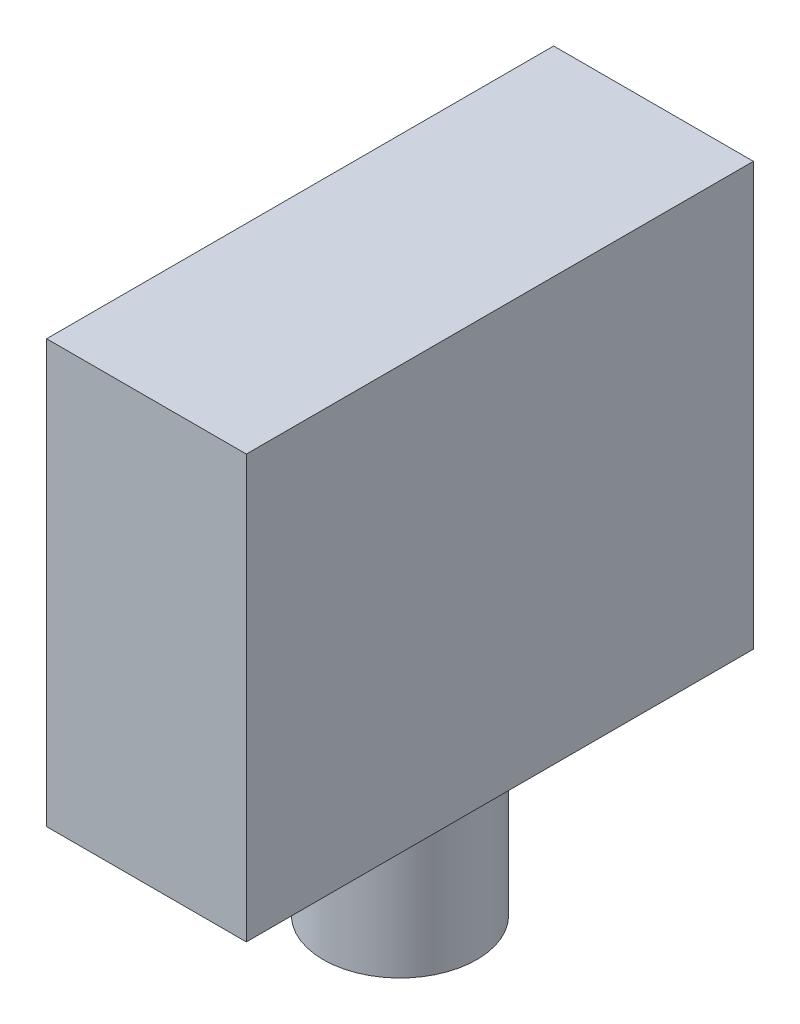
ISO-10303-21;
HEADER;
FILE_DESCRIPTION(('STEP AP214'),'2;1');
FILE_NAME('part.step','',(''),(''),'','','');
FILE_SCHEMA(('AUTOMOTIVE_DESIGN { 1 0 10303 214 1 1 1 1 }'));
ENDSEC;
DATA;
#1=APPLICATION_CONTEXT('core data for automotive mechanical design processes');
#2=APPLICATION_PROTOCOL_DEFINITION('international standard','automotive_design',2000,#1);
#3=PRODUCT_CONTEXT('',#1,'mechanical');
#4=PRODUCT('Part','Part','',(#3));
#5=PRODUCT_RELATED_PRODUCT_CATEGORY('part','',(#4));
#6=PRODUCT_DEFINITION_FORMATION('','',#4);
#7=PRODUCT_DEFINITION_CONTEXT('part definition',#1,'design');
#8=PRODUCT_DEFINITION('design','',#6,#7);
#9=PRODUCT_DEFINITION_SHAPE('','',#8);
#10=(LENGTH_UNIT() NAMED_UNIT(*) SI_UNIT(.MILLI.,.METRE.));
#11=(NAMED_UNIT(*) PLANE_ANGLE_UNIT() SI_UNIT($,.RADIAN.));
#12=(NAMED_UNIT(*) SI_UNIT($,.STERADIAN.) SOLID_ANGLE_UNIT());
#13=UNCERTAINTY_MEASURE_WITH_UNIT(LENGTH_MEASURE(1.E-05),#10,'distance_accuracy_value','');
#14=(GEOMETRIC_REPRESENTATION_CONTEXT(3) GLOBAL_UNCERTAINTY_ASSIGNED_CONTEXT((#13)) GLOBAL_UNIT_ASSIGNED_CONTEXT((#10,
#11,#12)) REPRESENTATION_CONTEXT('',''));
#15=CARTESIAN_POINT('',(0.,0.,0.));
#16=DIRECTION('',(0.,0.,1.));
#17=DIRECTION('',(1.,0.,0.));
#18=AXIS2_PLACEMENT_3D('',#15,#16,#17);
#19=CARTESIAN_POINT('',(-0.602941176470582,27.5,-12.9411764705882));
#20=DIRECTION('',(-1.,0.,0.));
#21=DIRECTION('',(0.,0.,1.));
#22=AXIS2_PLACEMENT_3D('',#19,#20,#21);
#23=PLANE('',#22);
#24=DIRECTION('',(0.,0.,-1.));
#25=VECTOR('',#24,1.);
#26=CARTESIAN_POINT('',(-0.602941176470582,0.,-12.9411764705882));
#27=LINE('',#26,#25);
#28=CARTESIAN_POINT('',(-0.60294117647058,0.,20.0588235294118));
#29=VERTEX_POINT('',#28);
#30=CARTESIAN_POINT('',(-0.602941176470582,0.,-12.9411764705882));
#31=VERTEX_POINT('',#30);
#32=EDGE_CURVE('E107',#29,#31,#27,.T.);
#33=ORIENTED_EDGE('',*,*,#32,.T.);
#34=DIRECTION('',(0.,-1.,0.));
#35=VECTOR('',#34,1.);
#36=CARTESIAN_POINT('',(-0.602941176470582,27.5,-12.9411764705882));
#37=LINE('',#36,#35);
#38=CARTESIAN_POINT('',(-0.602941176470582,27.5,-12.9411764705882));
#39=VERTEX_POINT('',#38);
#40=EDGE_CURVE('E11',#39,#31,#37,.T.);
#41=ORIENTED_EDGE('',*,*,#40,.F.);
#42=DIRECTION('',(0.,0.,-1.));
#43=VECTOR('',#42,1.);
#44=CARTESIAN_POINT('',(-0.602941176470582,27.5,-12.9411764705882));
#45=LINE('',#44,#43);
#46=CARTESIAN_POINT('',(-0.60294117647058,27.5,20.0588235294118));
#47=VERTEX_POINT('',#46);
#48=EDGE_CURVE('E91',#47,#39,#45,.T.);
#49=ORIENTED_EDGE('',*,*,#48,.F.);
#50=DIRECTION('',(0.,-1.,0.));
#51=VECTOR('',#50,1.);
#52=CARTESIAN_POINT('',(-0.60294117647058,27.5,20.0588235294118));
#53=LINE('',#52,#51);
#54=EDGE_CURVE('E103',#47,#29,#53,.T.);
#55=ORIENTED_EDGE('',*,*,#54,.T.);
#56=EDGE_LOOP('',(#33,#41,#49,#55));
#57=FACE_BOUND('',#56,.T.);
#58=ADVANCED_FACE('F39',(#57),#23,.F.);
#59=CARTESIAN_POINT('',(-0.602941176470582,27.5,-12.9411764705882));
#60=DIRECTION('',(0.,0.,1.));
#61=DIRECTION('',(1.,0.,0.));
#62=AXIS2_PLACEMENT_3D('',#59,#60,#61);
#63=PLANE('',#62);
#64=DIRECTION('',(-1.,0.,0.));
#65=VECTOR('',#64,1.);
#66=CARTESIAN_POINT('',(-0.602941176470582,0.,-12.9411764705882));
#67=LINE('',#66,#65);
#68=CARTESIAN_POINT('',(-13.6029411764706,0.,-12.9411764705882));
#69=VERTEX_POINT('',#68);
#70=EDGE_CURVE('E96',#31,#69,#67,.T.);
#71=ORIENTED_EDGE('',*,*,#70,.T.);
#72=DIRECTION('',(0.,-1.,0.));
#73=VECTOR('',#72,1.);
#74=CARTESIAN_POINT('',(-13.6029411764706,27.5,-12.9411764705882));
#75=LINE('',#74,#73);
#76=CARTESIAN_POINT('',(-13.6029411764706,27.5,-12.9411764705882));
#77=VERTEX_POINT('',#76);
#78=EDGE_CURVE('E48',#77,#69,#75,.T.);
#79=ORIENTED_EDGE('',*,*,#78,.F.);
#80=DIRECTION('',(-1.,0.,0.));
#81=VECTOR('',#80,1.);
#82=CARTESIAN_POINT('',(-0.602941176470582,27.5,-12.9411764705882));
#83=LINE('',#82,#81);
#84=EDGE_CURVE('E86',#39,#77,#83,.T.);
#85=ORIENTED_EDGE('',*,*,#84,.F.);
#86=ORIENTED_EDGE('',*,*,#40,.T.);
#87=EDGE_LOOP('',(#71,#79,#85,#86));
#88=FACE_BOUND('',#87,.T.);
#89=ADVANCED_FACE('F95',(#88),#63,.F.);
#90=CARTESIAN_POINT('',(-13.6029411764706,27.5,-12.9411764705882));
#91=DIRECTION('',(1.,0.,0.));
#92=DIRECTION('',(0.,0.,-1.));
#93=AXIS2_PLACEMENT_3D('',#90,#91,#92);
#94=PLANE('',#93);
#95=DIRECTION('',(0.,0.,1.));
#96=VECTOR('',#95,1.);
#97=CARTESIAN_POINT('',(-13.6029411764706,0.,-12.9411764705882));
#98=LINE('',#97,#96);
#99=CARTESIAN_POINT('',(-13.6029411764706,0.,20.0588235294118));
#100=VERTEX_POINT('',#99);
#101=EDGE_CURVE('E73',#69,#100,#98,.T.);
#102=ORIENTED_EDGE('',*,*,#101,.T.);
#103=DIRECTION('',(0.,-1.,0.));
#104=VECTOR('',#103,1.);
#105=CARTESIAN_POINT('',(-13.6029411764706,27.5,20.0588235294118));
#106=LINE('',#105,#104);
#107=CARTESIAN_POINT('',(-13.6029411764706,27.5,20.0588235294118));
#108=VERTEX_POINT('',#107);
#109=EDGE_CURVE('E98',#108,#100,#106,.T.);
#110=ORIENTED_EDGE('',*,*,#109,.F.);
#111=DIRECTION('',(0.,0.,1.));
#112=VECTOR('',#111,1.);
#113=CARTESIAN_POINT('',(-13.6029411764706,27.5,-12.9411764705882));
#114=LINE('',#113,#112);
#115=EDGE_CURVE('E89',#77,#108,#114,.T.);
#116=ORIENTED_EDGE('',*,*,#115,.F.);
#117=ORIENTED_EDGE('',*,*,#78,.T.);
#118=EDGE_LOOP('',(#102,#110,#116,#117));
#119=FACE_BOUND('',#118,.T.);
#120=ADVANCED_FACE('F99',(#119),#94,.F.);
#121=CARTESIAN_POINT('',(-0.60294117647058,27.5,20.0588235294118));
#122=DIRECTION('',(0.,0.,-1.));
#123=DIRECTION('',(-1.,0.,0.));
#124=AXIS2_PLACEMENT_3D('',#121,#122,#123);
#125=PLANE('',#124);
#126=DIRECTION('',(1.,0.,0.));
#127=VECTOR('',#126,1.);
#128=CARTESIAN_POINT('',(-0.60294117647058,0.,20.0588235294118));
#129=LINE('',#128,#127);
#130=EDGE_CURVE('E79',#100,#29,#129,.T.);
#131=ORIENTED_EDGE('',*,*,#130,.T.);
#132=ORIENTED_EDGE('',*,*,#54,.F.);
#133=DIRECTION('',(1.,0.,0.));
#134=VECTOR('',#133,1.);
#135=CARTESIAN_POINT('',(-0.60294117647058,27.5,20.0588235294118));
#136=LINE('',#135,#134);
#137=EDGE_CURVE('E56',#108,#47,#136,.T.);
#138=ORIENTED_EDGE('',*,*,#137,.F.);
#139=ORIENTED_EDGE('',*,*,#109,.T.);
#140=EDGE_LOOP('',(#131,#132,#138,#139));
#141=FACE_BOUND('',#140,.T.);
#142=ADVANCED_FACE('F121',(#141),#125,.F.);
#143=CARTESIAN_POINT('',(0.,27.5,0.));
#144=DIRECTION('',(0.,-1.,0.));
#145=DIRECTION('',(0.,0.,-1.));
#146=AXIS2_PLACEMENT_3D('',#143,#144,#145);
#147=PLANE('',#146);
#148=ORIENTED_EDGE('',*,*,#48,.T.);
#149=ORIENTED_EDGE('',*,*,#84,.T.);
#150=ORIENTED_EDGE('',*,*,#115,.T.);
#151=ORIENTED_EDGE('',*,*,#137,.T.);
#152=EDGE_LOOP('',(#148,#149,#150,#151));
#153=FACE_BOUND('',#152,.T.);
#154=ADVANCED_FACE('F87',(#153),#147,.F.);
#155=CARTESIAN_POINT('',(0.,0.,0.));
#156=DIRECTION('',(0.,-1.,0.));
#157=DIRECTION('',(0.,0.,-1.));
#158=AXIS2_PLACEMENT_3D('',#155,#156,#157);
#159=PLANE('',#158);
#160=CARTESIAN_POINT('',(-7.10294117647057,0.,3.55882352941177));
#161=DIRECTION('',(0.,1.,0.));
#162=DIRECTION('',(0.,0.,1.));
#163=AXIS2_PLACEMENT_3D('',#160,#161,#162);
#164=CIRCLE('',#163,5.);
#165=CARTESIAN_POINT('',(-7.10294117647057,0.,8.55882352941176));
#166=VERTEX_POINT('',#165);
#167=EDGE_CURVE('E128',#166,#166,#164,.T.);
#168=ORIENTED_EDGE('',*,*,#167,.T.);
#169=EDGE_LOOP('',(#168));
#170=FACE_BOUND('',#169,.T.);
#171=ORIENTED_EDGE('',*,*,#32,.F.);
#172=ORIENTED_EDGE('',*,*,#130,.F.);
#173=ORIENTED_EDGE('',*,*,#101,.F.);
#174=ORIENTED_EDGE('',*,*,#70,.F.);
#175=EDGE_LOOP('',(#171,#172,#173,#174));
#176=FACE_BOUND('',#175,.T.);
#177=ADVANCED_FACE('F124',(#170,#176),#159,.T.);
#178=CARTESIAN_POINT('',(-7.10294117647057,-10.,3.55882352941177));
#179=DIRECTION('',(0.,1.,0.));
#180=DIRECTION('',(0.,0.,1.));
#181=AXIS2_PLACEMENT_3D('',#178,#179,#180);
#182=CYLINDRICAL_SURFACE('',#181,5.);
#183=CARTESIAN_POINT('',(-7.10294117647057,-10.,3.55882352941177));
#184=DIRECTION('',(0.,1.,0.));
#185=DIRECTION('',(0.,0.,1.));
#186=AXIS2_PLACEMENT_3D('',#183,#184,#185);
#187=CIRCLE('',#186,5.);
#188=CARTESIAN_POINT('',(-7.10294117647057,-10.,8.55882352941176));
#189=VERTEX_POINT('',#188);
#190=EDGE_CURVE('E111',#189,#189,#187,.T.);
#191=ORIENTED_EDGE('',*,*,#190,.T.);
#192=EDGE_LOOP('',(#191));
#193=FACE_BOUND('',#192,.T.);
#194=ORIENTED_EDGE('',*,*,#167,.F.);
#195=EDGE_LOOP('',(#194));
#196=FACE_BOUND('',#195,.T.);
#197=ADVANCED_FACE('F136',(#193,#196),#182,.T.);
#198=CARTESIAN_POINT('',(-7.10294117647057,-10.,3.55882352941177));
#199=DIRECTION('',(0.,1.,0.));
#200=DIRECTION('',(0.,0.,1.));
#201=AXIS2_PLACEMENT_3D('',#198,#199,#200);
#202=PLANE('',#201);
#203=ORIENTED_EDGE('',*,*,#190,.F.);
#204=EDGE_LOOP('',(#203));
#205=FACE_BOUND('',#204,.T.);
#206=ADVANCED_FACE('F139',(#205),#202,.F.);
#207=CLOSED_SHELL('',(#58,#89,#120,#142,#154,#177,#197,#206));
#208=MANIFOLD_SOLID_BREP('B2',#207);
#209=ADVANCED_BREP_SHAPE_REPRESENTATION('',(#18,#208),#14);
#210=SHAPE_DEFINITION_REPRESENTATION(#9,#209);
ENDSEC;
END-ISO-10303-21;
